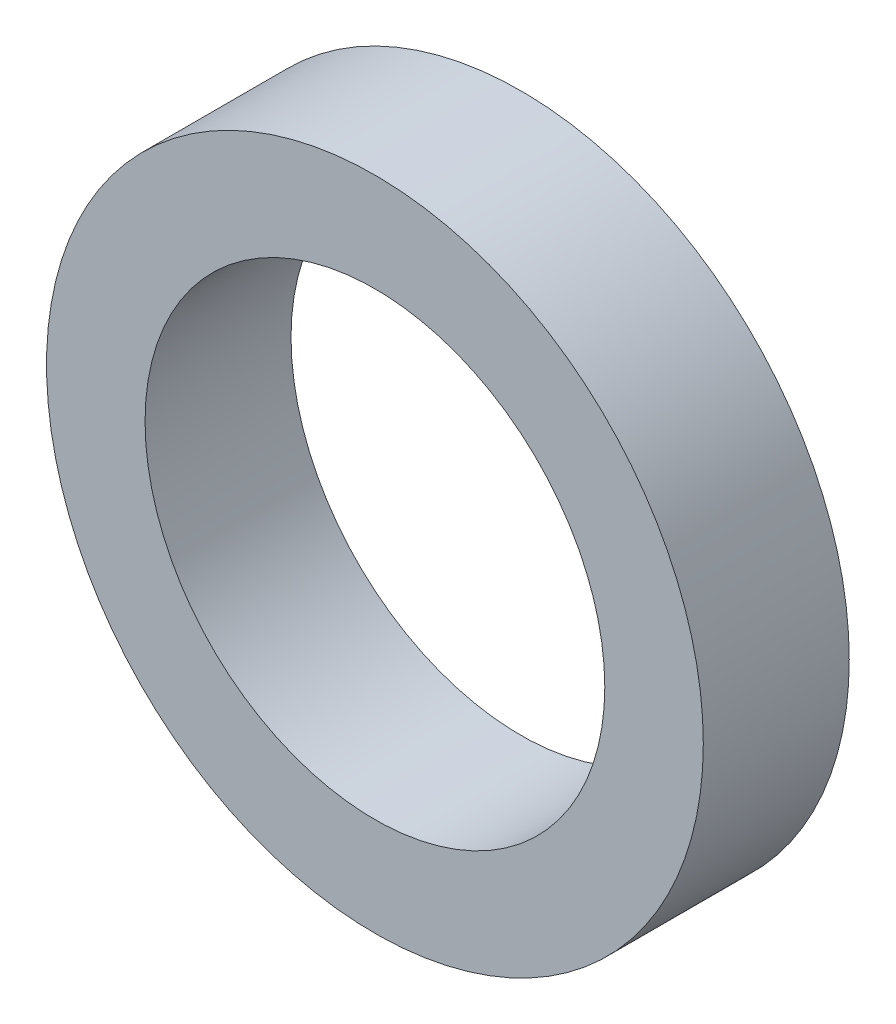
ISO-10303-21;
HEADER;
FILE_DESCRIPTION(('STEP AP214'),'2;1');
FILE_NAME('part.step','',(''),(''),'','','');
FILE_SCHEMA(('AUTOMOTIVE_DESIGN { 1 0 10303 214 1 1 1 1 }'));
ENDSEC;
DATA;
#1=APPLICATION_CONTEXT('core data for automotive mechanical design processes');
#2=APPLICATION_PROTOCOL_DEFINITION('international standard','automotive_design',2000,#1);
#3=PRODUCT_CONTEXT('',#1,'mechanical');
#4=PRODUCT('Part','Part','',(#3));
#5=PRODUCT_RELATED_PRODUCT_CATEGORY('part','',(#4));
#6=PRODUCT_DEFINITION_FORMATION('','',#4);
#7=PRODUCT_DEFINITION_CONTEXT('part definition',#1,'design');
#8=PRODUCT_DEFINITION('design','',#6,#7);
#9=PRODUCT_DEFINITION_SHAPE('','',#8);
#10=(LENGTH_UNIT() NAMED_UNIT(*) SI_UNIT(.MILLI.,.METRE.));
#11=(NAMED_UNIT(*) PLANE_ANGLE_UNIT() SI_UNIT($,.RADIAN.));
#12=(NAMED_UNIT(*) SI_UNIT($,.STERADIAN.) SOLID_ANGLE_UNIT());
#13=UNCERTAINTY_MEASURE_WITH_UNIT(LENGTH_MEASURE(1.E-05),#10,'distance_accuracy_value','');
#14=(GEOMETRIC_REPRESENTATION_CONTEXT(3) GLOBAL_UNCERTAINTY_ASSIGNED_CONTEXT((#13)) GLOBAL_UNIT_ASSIGNED_CONTEXT((#10,
#11,#12)) REPRESENTATION_CONTEXT('',''));
#15=CARTESIAN_POINT('',(0.,0.,0.));
#16=DIRECTION('',(0.,0.,1.));
#17=DIRECTION('',(1.,0.,0.));
#18=AXIS2_PLACEMENT_3D('',#15,#16,#17);
#19=CARTESIAN_POINT('',(0.,0.,10.));
#20=DIRECTION('',(0.,0.,1.));
#21=DIRECTION('',(1.,0.,0.));
#22=AXIS2_PLACEMENT_3D('',#19,#20,#21);
#23=PLANE('',#22);
#24=CARTESIAN_POINT('',(0.,0.,10.));
#25=DIRECTION('',(0.,0.,1.));
#26=DIRECTION('',(1.,0.,0.));
#27=AXIS2_PLACEMENT_3D('',#24,#25,#26);
#28=CIRCLE('',#27,22.5);
#29=CARTESIAN_POINT('',(22.5,0.,10.));
#30=VERTEX_POINT('',#29);
#31=EDGE_CURVE('E10',#30,#30,#28,.T.);
#32=ORIENTED_EDGE('',*,*,#31,.T.);
#33=EDGE_LOOP('',(#32));
#34=FACE_BOUND('',#33,.T.);
#35=CARTESIAN_POINT('',(0.,0.,10.));
#36=DIRECTION('',(0.,0.,1.));
#37=DIRECTION('',(1.,0.,0.));
#38=AXIS2_PLACEMENT_3D('',#35,#36,#37);
#39=CIRCLE('',#38,15.75);
#40=CARTESIAN_POINT('',(15.75,0.,10.));
#41=VERTEX_POINT('',#40);
#42=EDGE_CURVE('E43',#41,#41,#39,.T.);
#43=ORIENTED_EDGE('',*,*,#42,.F.);
#44=EDGE_LOOP('',(#43));
#45=FACE_BOUND('',#44,.T.);
#46=ADVANCED_FACE('F32',(#34,#45),#23,.T.);
#47=CARTESIAN_POINT('',(0.,0.,0.));
#48=DIRECTION('',(0.,0.,1.));
#49=DIRECTION('',(1.,0.,0.));
#50=AXIS2_PLACEMENT_3D('',#47,#48,#49);
#51=PLANE('',#50);
#52=CARTESIAN_POINT('',(0.,0.,0.));
#53=DIRECTION('',(0.,0.,1.));
#54=DIRECTION('',(1.,0.,0.));
#55=AXIS2_PLACEMENT_3D('',#52,#53,#54);
#56=CIRCLE('',#55,22.5);
#57=CARTESIAN_POINT('',(22.5,0.,0.));
#58=VERTEX_POINT('',#57);
#59=EDGE_CURVE('E36',#58,#58,#56,.T.);
#60=ORIENTED_EDGE('',*,*,#59,.F.);
#61=EDGE_LOOP('',(#60));
#62=FACE_BOUND('',#61,.T.);
#63=CARTESIAN_POINT('',(0.,0.,0.));
#64=DIRECTION('',(0.,0.,1.));
#65=DIRECTION('',(1.,0.,0.));
#66=AXIS2_PLACEMENT_3D('',#63,#64,#65);
#67=CIRCLE('',#66,15.75);
#68=CARTESIAN_POINT('',(15.75,0.,0.));
#69=VERTEX_POINT('',#68);
#70=EDGE_CURVE('E45',#69,#69,#67,.T.);
#71=ORIENTED_EDGE('',*,*,#70,.T.);
#72=EDGE_LOOP('',(#71));
#73=FACE_BOUND('',#72,.T.);
#74=ADVANCED_FACE('F55',(#62,#73),#51,.F.);
#75=CARTESIAN_POINT('',(0.,0.,10.));
#76=DIRECTION('',(0.,0.,-1.));
#77=DIRECTION('',(-1.,0.,0.));
#78=AXIS2_PLACEMENT_3D('',#75,#76,#77);
#79=CYLINDRICAL_SURFACE('',#78,22.5);
#80=ORIENTED_EDGE('',*,*,#31,.F.);
#81=EDGE_LOOP('',(#80));
#82=FACE_BOUND('',#81,.T.);
#83=ORIENTED_EDGE('',*,*,#59,.T.);
#84=EDGE_LOOP('',(#83));
#85=FACE_BOUND('',#84,.T.);
#86=ADVANCED_FACE('F34',(#82,#85),#79,.T.);
#87=CARTESIAN_POINT('',(0.,0.,10.));
#88=DIRECTION('',(0.,0.,-1.));
#89=DIRECTION('',(-1.,0.,0.));
#90=AXIS2_PLACEMENT_3D('',#87,#88,#89);
#91=CYLINDRICAL_SURFACE('',#90,15.75);
#92=ORIENTED_EDGE('',*,*,#42,.T.);
#93=EDGE_LOOP('',(#92));
#94=FACE_BOUND('',#93,.T.);
#95=ORIENTED_EDGE('',*,*,#70,.F.);
#96=EDGE_LOOP('',(#95));
#97=FACE_BOUND('',#96,.T.);
#98=ADVANCED_FACE('F51',(#94,#97),#91,.F.);
#99=CLOSED_SHELL('',(#46,#74,#86,#98));
#100=MANIFOLD_SOLID_BREP('B2',#99);
#101=ADVANCED_BREP_SHAPE_REPRESENTATION('',(#18,#100),#14);
#102=SHAPE_DEFINITION_REPRESENTATION(#9,#101);
ENDSEC;
END-ISO-10303-21;
